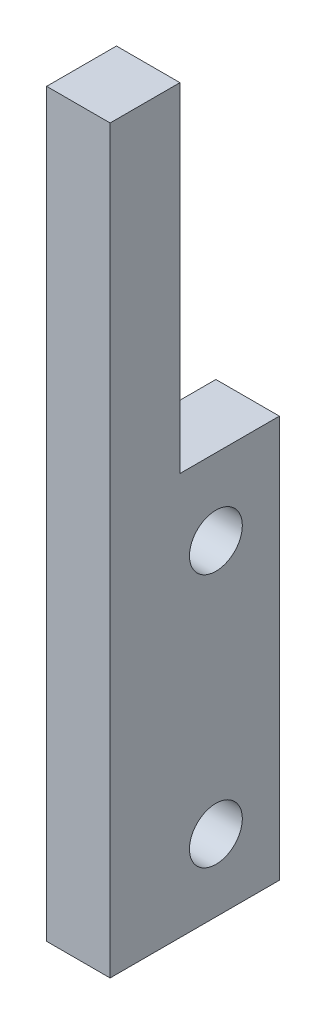
ISO-10303-21;
HEADER;
FILE_DESCRIPTION(('STEP AP214'),'2;1');
FILE_NAME('part.step','',(''),(''),'','','');
FILE_SCHEMA(('AUTOMOTIVE_DESIGN { 1 0 10303 214 1 1 1 1 }'));
ENDSEC;
DATA;
#1=APPLICATION_CONTEXT('core data for automotive mechanical design processes');
#2=APPLICATION_PROTOCOL_DEFINITION('international standard','automotive_design',2000,#1);
#3=PRODUCT_CONTEXT('',#1,'mechanical');
#4=PRODUCT('Part','Part','',(#3));
#5=PRODUCT_RELATED_PRODUCT_CATEGORY('part','',(#4));
#6=PRODUCT_DEFINITION_FORMATION('','',#4);
#7=PRODUCT_DEFINITION_CONTEXT('part definition',#1,'design');
#8=PRODUCT_DEFINITION('design','',#6,#7);
#9=PRODUCT_DEFINITION_SHAPE('','',#8);
#10=(LENGTH_UNIT() NAMED_UNIT(*) SI_UNIT(.MILLI.,.METRE.));
#11=(NAMED_UNIT(*) PLANE_ANGLE_UNIT() SI_UNIT($,.RADIAN.));
#12=(NAMED_UNIT(*) SI_UNIT($,.STERADIAN.) SOLID_ANGLE_UNIT());
#13=UNCERTAINTY_MEASURE_WITH_UNIT(LENGTH_MEASURE(1.E-05),#10,'distance_accuracy_value','');
#14=(GEOMETRIC_REPRESENTATION_CONTEXT(3) GLOBAL_UNCERTAINTY_ASSIGNED_CONTEXT((#13)) GLOBAL_UNIT_ASSIGNED_CONTEXT((#10,
#11,#12)) REPRESENTATION_CONTEXT('',''));
#15=CARTESIAN_POINT('',(0.,0.,0.));
#16=DIRECTION('',(0.,0.,1.));
#17=DIRECTION('',(1.,0.,0.));
#18=AXIS2_PLACEMENT_3D('',#15,#16,#17);
#19=CARTESIAN_POINT('',(3.,0.,0.));
#20=DIRECTION('',(-1.,0.,0.));
#21=DIRECTION('',(0.,0.,1.));
#22=AXIS2_PLACEMENT_3D('',#19,#20,#21);
#23=PLANE('',#22);
#24=CARTESIAN_POINT('',(3.,15.4,-5.));
#25=DIRECTION('',(1.,0.,0.));
#26=DIRECTION('',(0.,0.,-1.));
#27=AXIS2_PLACEMENT_3D('',#24,#25,#26);
#28=CIRCLE('',#27,1.25);
#29=CARTESIAN_POINT('',(3.,15.4,-6.25));
#30=VERTEX_POINT('',#29);
#31=EDGE_CURVE('E172',#30,#30,#28,.T.);
#32=ORIENTED_EDGE('',*,*,#31,.F.);
#33=EDGE_LOOP('',(#32));
#34=FACE_BOUND('',#33,.T.);
#35=DIRECTION('',(0.,0.,-1.));
#36=VECTOR('',#35,1.);
#37=CARTESIAN_POINT('',(3.,0.,-8.));
#38=LINE('',#37,#36);
#39=CARTESIAN_POINT('',(3.,0.,0.));
#40=VERTEX_POINT('',#39);
#41=CARTESIAN_POINT('',(3.,0.,-8.));
#42=VERTEX_POINT('',#41);
#43=EDGE_CURVE('E129',#40,#42,#38,.T.);
#44=ORIENTED_EDGE('',*,*,#43,.T.);
#45=DIRECTION('',(0.,1.,0.));
#46=VECTOR('',#45,1.);
#47=CARTESIAN_POINT('',(3.,19.,-8.));
#48=LINE('',#47,#46);
#49=CARTESIAN_POINT('',(3.,19.,-8.));
#50=VERTEX_POINT('',#49);
#51=EDGE_CURVE('E87',#42,#50,#48,.T.);
#52=ORIENTED_EDGE('',*,*,#51,.T.);
#53=DIRECTION('',(0.,0.,1.));
#54=VECTOR('',#53,1.);
#55=CARTESIAN_POINT('',(3.,19.,-3.3));
#56=LINE('',#55,#54);
#57=CARTESIAN_POINT('',(3.,19.,-3.3));
#58=VERTEX_POINT('',#57);
#59=EDGE_CURVE('E100',#50,#58,#56,.T.);
#60=ORIENTED_EDGE('',*,*,#59,.T.);
#61=DIRECTION('',(0.,1.,0.));
#62=VECTOR('',#61,1.);
#63=CARTESIAN_POINT('',(3.,35.,-3.3));
#64=LINE('',#63,#62);
#65=CARTESIAN_POINT('',(3.,35.,-3.3));
#66=VERTEX_POINT('',#65);
#67=EDGE_CURVE('E94',#58,#66,#64,.T.);
#68=ORIENTED_EDGE('',*,*,#67,.T.);
#69=DIRECTION('',(0.,0.,1.));
#70=VECTOR('',#69,1.);
#71=CARTESIAN_POINT('',(3.,35.,0.));
#72=LINE('',#71,#70);
#73=CARTESIAN_POINT('',(3.,35.,0.));
#74=VERTEX_POINT('',#73);
#75=EDGE_CURVE('E98',#66,#74,#72,.T.);
#76=ORIENTED_EDGE('',*,*,#75,.T.);
#77=DIRECTION('',(0.,-1.,0.));
#78=VECTOR('',#77,1.);
#79=CARTESIAN_POINT('',(3.,0.,0.));
#80=LINE('',#79,#78);
#81=EDGE_CURVE('E50',#74,#40,#80,.T.);
#82=ORIENTED_EDGE('',*,*,#81,.T.);
#83=EDGE_LOOP('',(#44,#52,#60,#68,#76,#82));
#84=FACE_BOUND('',#83,.T.);
#85=CARTESIAN_POINT('',(3.,3.4,-5.));
#86=DIRECTION('',(1.,0.,0.));
#87=DIRECTION('',(0.,0.,-1.));
#88=AXIS2_PLACEMENT_3D('',#85,#86,#87);
#89=CIRCLE('',#88,1.25);
#90=CARTESIAN_POINT('',(3.,3.4,-6.25));
#91=VERTEX_POINT('',#90);
#92=EDGE_CURVE('E176',#91,#91,#89,.T.);
#93=ORIENTED_EDGE('',*,*,#92,.F.);
#94=EDGE_LOOP('',(#93));
#95=FACE_BOUND('',#94,.T.);
#96=ADVANCED_FACE('F33',(#34,#84,#95),#23,.F.);
#97=CARTESIAN_POINT('',(3.,0.,-8.));
#98=DIRECTION('',(0.,1.,0.));
#99=DIRECTION('',(0.,0.,1.));
#100=AXIS2_PLACEMENT_3D('',#97,#98,#99);
#101=PLANE('',#100);
#102=DIRECTION('',(0.,0.,-1.));
#103=VECTOR('',#102,1.);
#104=CARTESIAN_POINT('',(0.,0.,-8.));
#105=LINE('',#104,#103);
#106=CARTESIAN_POINT('',(0.,0.,0.));
#107=VERTEX_POINT('',#106);
#108=CARTESIAN_POINT('',(0.,0.,-8.));
#109=VERTEX_POINT('',#108);
#110=EDGE_CURVE('E118',#107,#109,#105,.T.);
#111=ORIENTED_EDGE('',*,*,#110,.T.);
#112=DIRECTION('',(-1.,0.,0.));
#113=VECTOR('',#112,1.);
#114=CARTESIAN_POINT('',(3.,0.,-8.));
#115=LINE('',#114,#113);
#116=EDGE_CURVE('E11',#42,#109,#115,.T.);
#117=ORIENTED_EDGE('',*,*,#116,.F.);
#118=ORIENTED_EDGE('',*,*,#43,.F.);
#119=DIRECTION('',(-1.,0.,0.));
#120=VECTOR('',#119,1.);
#121=CARTESIAN_POINT('',(3.,0.,0.));
#122=LINE('',#121,#120);
#123=EDGE_CURVE('E114',#40,#107,#122,.T.);
#124=ORIENTED_EDGE('',*,*,#123,.T.);
#125=EDGE_LOOP('',(#111,#117,#118,#124));
#126=FACE_BOUND('',#125,.T.);
#127=ADVANCED_FACE('F35',(#126),#101,.F.);
#128=CARTESIAN_POINT('',(3.,19.,-8.));
#129=DIRECTION('',(0.,0.,1.));
#130=DIRECTION('',(0.,-1.,0.));
#131=AXIS2_PLACEMENT_3D('',#128,#129,#130);
#132=PLANE('',#131);
#133=DIRECTION('',(0.,1.,0.));
#134=VECTOR('',#133,1.);
#135=CARTESIAN_POINT('',(0.,19.,-8.));
#136=LINE('',#135,#134);
#137=CARTESIAN_POINT('',(0.,19.,-8.));
#138=VERTEX_POINT('',#137);
#139=EDGE_CURVE('E121',#109,#138,#136,.T.);
#140=ORIENTED_EDGE('',*,*,#139,.T.);
#141=DIRECTION('',(-1.,0.,0.));
#142=VECTOR('',#141,1.);
#143=CARTESIAN_POINT('',(3.,19.,-8.));
#144=LINE('',#143,#142);
#145=EDGE_CURVE('E42',#50,#138,#144,.T.);
#146=ORIENTED_EDGE('',*,*,#145,.F.);
#147=ORIENTED_EDGE('',*,*,#51,.F.);
#148=ORIENTED_EDGE('',*,*,#116,.T.);
#149=EDGE_LOOP('',(#140,#146,#147,#148));
#150=FACE_BOUND('',#149,.T.);
#151=ADVANCED_FACE('F159',(#150),#132,.F.);
#152=CARTESIAN_POINT('',(3.,19.,-3.3));
#153=DIRECTION('',(0.,-1.,0.));
#154=DIRECTION('',(0.,0.,-1.));
#155=AXIS2_PLACEMENT_3D('',#152,#153,#154);
#156=PLANE('',#155);
#157=DIRECTION('',(0.,0.,1.));
#158=VECTOR('',#157,1.);
#159=CARTESIAN_POINT('',(0.,19.,-3.3));
#160=LINE('',#159,#158);
#161=CARTESIAN_POINT('',(0.,19.,-3.3));
#162=VERTEX_POINT('',#161);
#163=EDGE_CURVE('E124',#138,#162,#160,.T.);
#164=ORIENTED_EDGE('',*,*,#163,.T.);
#165=DIRECTION('',(-1.,0.,0.));
#166=VECTOR('',#165,1.);
#167=CARTESIAN_POINT('',(3.,19.,-3.3));
#168=LINE('',#167,#166);
#169=EDGE_CURVE('E109',#58,#162,#168,.T.);
#170=ORIENTED_EDGE('',*,*,#169,.F.);
#171=ORIENTED_EDGE('',*,*,#59,.F.);
#172=ORIENTED_EDGE('',*,*,#145,.T.);
#173=EDGE_LOOP('',(#164,#170,#171,#172));
#174=FACE_BOUND('',#173,.T.);
#175=ADVANCED_FACE('F135',(#174),#156,.F.);
#176=CARTESIAN_POINT('',(3.,35.,-3.3));
#177=DIRECTION('',(0.,0.,1.));
#178=DIRECTION('',(0.,-1.,0.));
#179=AXIS2_PLACEMENT_3D('',#176,#177,#178);
#180=PLANE('',#179);
#181=DIRECTION('',(0.,1.,0.));
#182=VECTOR('',#181,1.);
#183=CARTESIAN_POINT('',(0.,35.,-3.3));
#184=LINE('',#183,#182);
#185=CARTESIAN_POINT('',(0.,35.,-3.3));
#186=VERTEX_POINT('',#185);
#187=EDGE_CURVE('E108',#162,#186,#184,.T.);
#188=ORIENTED_EDGE('',*,*,#187,.T.);
#189=DIRECTION('',(-1.,0.,0.));
#190=VECTOR('',#189,1.);
#191=CARTESIAN_POINT('',(3.,35.,-3.3));
#192=LINE('',#191,#190);
#193=EDGE_CURVE('E105',#66,#186,#192,.T.);
#194=ORIENTED_EDGE('',*,*,#193,.F.);
#195=ORIENTED_EDGE('',*,*,#67,.F.);
#196=ORIENTED_EDGE('',*,*,#169,.T.);
#197=EDGE_LOOP('',(#188,#194,#195,#196));
#198=FACE_BOUND('',#197,.T.);
#199=ADVANCED_FACE('F106',(#198),#180,.F.);
#200=CARTESIAN_POINT('',(3.,35.,0.));
#201=DIRECTION('',(0.,-1.,0.));
#202=DIRECTION('',(0.,0.,-1.));
#203=AXIS2_PLACEMENT_3D('',#200,#201,#202);
#204=PLANE('',#203);
#205=DIRECTION('',(0.,0.,1.));
#206=VECTOR('',#205,1.);
#207=CARTESIAN_POINT('',(0.,35.,0.));
#208=LINE('',#207,#206);
#209=CARTESIAN_POINT('',(0.,35.,0.));
#210=VERTEX_POINT('',#209);
#211=EDGE_CURVE('E73',#186,#210,#208,.T.);
#212=ORIENTED_EDGE('',*,*,#211,.T.);
#213=DIRECTION('',(-1.,0.,0.));
#214=VECTOR('',#213,1.);
#215=CARTESIAN_POINT('',(3.,35.,0.));
#216=LINE('',#215,#214);
#217=EDGE_CURVE('E110',#74,#210,#216,.T.);
#218=ORIENTED_EDGE('',*,*,#217,.F.);
#219=ORIENTED_EDGE('',*,*,#75,.F.);
#220=ORIENTED_EDGE('',*,*,#193,.T.);
#221=EDGE_LOOP('',(#212,#218,#219,#220));
#222=FACE_BOUND('',#221,.T.);
#223=ADVANCED_FACE('F112',(#222),#204,.F.);
#224=CARTESIAN_POINT('',(3.,0.,0.));
#225=DIRECTION('',(0.,0.,-1.));
#226=DIRECTION('',(-1.,0.,0.));
#227=AXIS2_PLACEMENT_3D('',#224,#225,#226);
#228=PLANE('',#227);
#229=DIRECTION('',(0.,-1.,0.));
#230=VECTOR('',#229,1.);
#231=CARTESIAN_POINT('',(0.,0.,0.));
#232=LINE('',#231,#230);
#233=EDGE_CURVE('E79',#210,#107,#232,.T.);
#234=ORIENTED_EDGE('',*,*,#233,.T.);
#235=ORIENTED_EDGE('',*,*,#123,.F.);
#236=ORIENTED_EDGE('',*,*,#81,.F.);
#237=ORIENTED_EDGE('',*,*,#217,.T.);
#238=EDGE_LOOP('',(#234,#235,#236,#237));
#239=FACE_BOUND('',#238,.T.);
#240=ADVANCED_FACE('F142',(#239),#228,.F.);
#241=CARTESIAN_POINT('',(0.,0.,0.));
#242=DIRECTION('',(-1.,0.,0.));
#243=DIRECTION('',(0.,0.,1.));
#244=AXIS2_PLACEMENT_3D('',#241,#242,#243);
#245=PLANE('',#244);
#246=CARTESIAN_POINT('',(0.,15.4,-5.));
#247=DIRECTION('',(-1.,0.,0.));
#248=DIRECTION('',(0.,0.,1.));
#249=AXIS2_PLACEMENT_3D('',#246,#247,#248);
#250=CIRCLE('',#249,1.25);
#251=CARTESIAN_POINT('',(0.,15.4,-3.75));
#252=VERTEX_POINT('',#251);
#253=EDGE_CURVE('E175',#252,#252,#250,.T.);
#254=ORIENTED_EDGE('',*,*,#253,.F.);
#255=EDGE_LOOP('',(#254));
#256=FACE_BOUND('',#255,.T.);
#257=CARTESIAN_POINT('',(0.,3.4,-5.));
#258=DIRECTION('',(-1.,0.,0.));
#259=DIRECTION('',(0.,0.,1.));
#260=AXIS2_PLACEMENT_3D('',#257,#258,#259);
#261=CIRCLE('',#260,1.25);
#262=CARTESIAN_POINT('',(0.,3.4,-3.75));
#263=VERTEX_POINT('',#262);
#264=EDGE_CURVE('E122',#263,#263,#261,.T.);
#265=ORIENTED_EDGE('',*,*,#264,.F.);
#266=EDGE_LOOP('',(#265));
#267=FACE_BOUND('',#266,.T.);
#268=ORIENTED_EDGE('',*,*,#110,.F.);
#269=ORIENTED_EDGE('',*,*,#233,.F.);
#270=ORIENTED_EDGE('',*,*,#211,.F.);
#271=ORIENTED_EDGE('',*,*,#187,.F.);
#272=ORIENTED_EDGE('',*,*,#163,.F.);
#273=ORIENTED_EDGE('',*,*,#139,.F.);
#274=EDGE_LOOP('',(#268,#269,#270,#271,#272,#273));
#275=FACE_BOUND('',#274,.T.);
#276=ADVANCED_FACE('F138',(#256,#267,#275),#245,.T.);
#277=CARTESIAN_POINT('',(3.,3.4,-5.));
#278=DIRECTION('',(1.,0.,0.));
#279=DIRECTION('',(0.,0.,-1.));
#280=AXIS2_PLACEMENT_3D('',#277,#278,#279);
#281=CYLINDRICAL_SURFACE('',#280,1.25);
#282=ORIENTED_EDGE('',*,*,#92,.T.);
#283=EDGE_LOOP('',(#282));
#284=FACE_BOUND('',#283,.T.);
#285=ORIENTED_EDGE('',*,*,#264,.T.);
#286=EDGE_LOOP('',(#285));
#287=FACE_BOUND('',#286,.T.);
#288=ADVANCED_FACE('F149',(#284,#287),#281,.F.);
#289=CARTESIAN_POINT('',(3.,15.4,-5.));
#290=DIRECTION('',(1.,0.,0.));
#291=DIRECTION('',(0.,0.,-1.));
#292=AXIS2_PLACEMENT_3D('',#289,#290,#291);
#293=CYLINDRICAL_SURFACE('',#292,1.25);
#294=ORIENTED_EDGE('',*,*,#31,.T.);
#295=EDGE_LOOP('',(#294));
#296=FACE_BOUND('',#295,.T.);
#297=ORIENTED_EDGE('',*,*,#253,.T.);
#298=EDGE_LOOP('',(#297));
#299=FACE_BOUND('',#298,.T.);
#300=ADVANCED_FACE('F164',(#296,#299),#293,.F.);
#301=CLOSED_SHELL('',(#96,#127,#151,#175,#199,#223,#240,#276,#288,#300));
#302=MANIFOLD_SOLID_BREP('B2',#301);
#303=ADVANCED_BREP_SHAPE_REPRESENTATION('',(#18,#302),#14);
#304=SHAPE_DEFINITION_REPRESENTATION(#9,#303);
ENDSEC;
END-ISO-10303-21;
